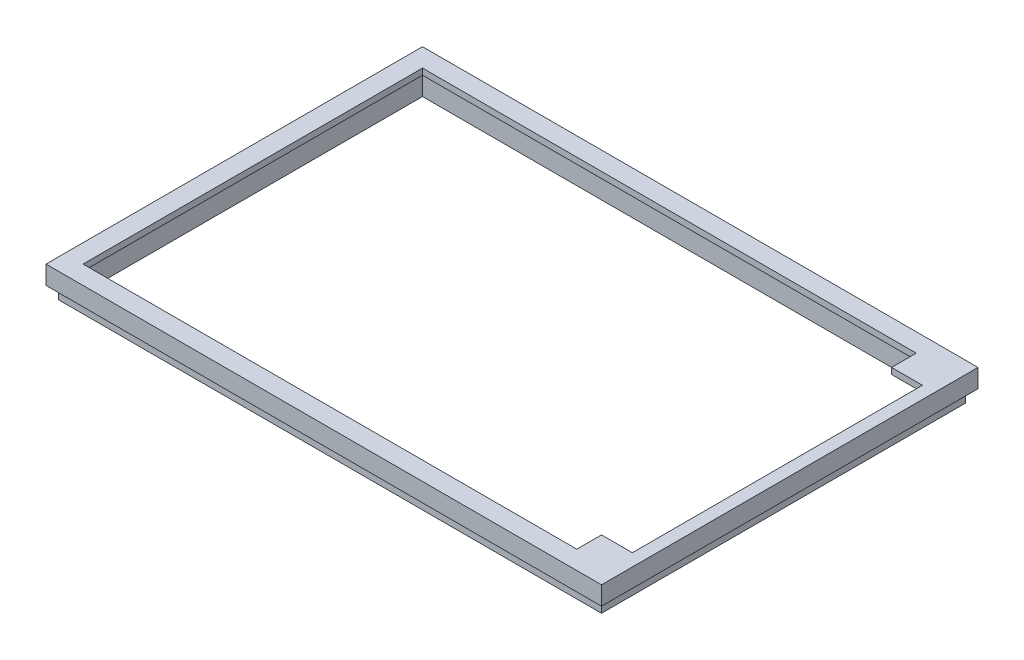
ISO-10303-21;
HEADER;
FILE_DESCRIPTION(('STEP AP214'),'2;1');
FILE_NAME('part.step','',(''),(''),'','','');
FILE_SCHEMA(('AUTOMOTIVE_DESIGN { 1 0 10303 214 1 1 1 1 }'));
ENDSEC;
DATA;
#1=APPLICATION_CONTEXT('core data for automotive mechanical design processes');
#2=APPLICATION_PROTOCOL_DEFINITION('international standard','automotive_design',2000,#1);
#3=PRODUCT_CONTEXT('',#1,'mechanical');
#4=PRODUCT('Part','Part','',(#3));
#5=PRODUCT_RELATED_PRODUCT_CATEGORY('part','',(#4));
#6=PRODUCT_DEFINITION_FORMATION('','',#4);
#7=PRODUCT_DEFINITION_CONTEXT('part definition',#1,'design');
#8=PRODUCT_DEFINITION('design','',#6,#7);
#9=PRODUCT_DEFINITION_SHAPE('','',#8);
#10=(LENGTH_UNIT() NAMED_UNIT(*) SI_UNIT(.MILLI.,.METRE.));
#11=(NAMED_UNIT(*) PLANE_ANGLE_UNIT() SI_UNIT($,.RADIAN.));
#12=(NAMED_UNIT(*) SI_UNIT($,.STERADIAN.) SOLID_ANGLE_UNIT());
#13=UNCERTAINTY_MEASURE_WITH_UNIT(LENGTH_MEASURE(1.E-05),#10,'distance_accuracy_value','');
#14=(GEOMETRIC_REPRESENTATION_CONTEXT(3) GLOBAL_UNCERTAINTY_ASSIGNED_CONTEXT((#13)) GLOBAL_UNIT_ASSIGNED_CONTEXT((#10,
#11,#12)) REPRESENTATION_CONTEXT('',''));
#15=CARTESIAN_POINT('',(0.,0.,0.));
#16=DIRECTION('',(0.,0.,1.));
#17=DIRECTION('',(1.,0.,0.));
#18=AXIS2_PLACEMENT_3D('',#15,#16,#17);
#19=CARTESIAN_POINT('',(0.,0.,0.));
#20=DIRECTION('',(0.,1.,0.));
#21=DIRECTION('',(0.,0.,1.));
#22=AXIS2_PLACEMENT_3D('',#19,#20,#21);
#23=PLANE('',#22);
#24=DIRECTION('',(0.,0.,1.));
#25=VECTOR('',#24,1.);
#26=CARTESIAN_POINT('',(0.,0.,-61.));
#27=LINE('',#26,#25);
#28=CARTESIAN_POINT('',(0.,0.,-61.));
#29=VERTEX_POINT('',#28);
#30=CARTESIAN_POINT('',(0.,0.,0.));
#31=VERTEX_POINT('',#30);
#32=EDGE_CURVE('E299',#29,#31,#27,.T.);
#33=ORIENTED_EDGE('',*,*,#32,.F.);
#34=DIRECTION('',(-1.,0.,0.));
#35=VECTOR('',#34,1.);
#36=CARTESIAN_POINT('',(90.,0.,-61.));
#37=LINE('',#36,#35);
#38=CARTESIAN_POINT('',(90.,0.,-61.));
#39=VERTEX_POINT('',#38);
#40=EDGE_CURVE('E304',#39,#29,#37,.T.);
#41=ORIENTED_EDGE('',*,*,#40,.F.);
#42=DIRECTION('',(0.,0.,-1.));
#43=VECTOR('',#42,1.);
#44=CARTESIAN_POINT('',(90.,0.,0.));
#45=LINE('',#44,#43);
#46=CARTESIAN_POINT('',(90.,0.,0.));
#47=VERTEX_POINT('',#46);
#48=EDGE_CURVE('E315',#47,#39,#45,.T.);
#49=ORIENTED_EDGE('',*,*,#48,.F.);
#50=DIRECTION('',(1.,0.,0.));
#51=VECTOR('',#50,1.);
#52=CARTESIAN_POINT('',(0.,0.,0.));
#53=LINE('',#52,#51);
#54=EDGE_CURVE('E313',#31,#47,#53,.T.);
#55=ORIENTED_EDGE('',*,*,#54,.F.);
#56=EDGE_LOOP('',(#33,#41,#49,#55));
#57=FACE_BOUND('',#56,.T.);
#58=DIRECTION('',(0.,0.,-1.));
#59=VECTOR('',#58,1.);
#60=CARTESIAN_POINT('',(1.,0.,-60.));
#61=LINE('',#60,#59);
#62=CARTESIAN_POINT('',(1.,0.,-1.));
#63=VERTEX_POINT('',#62);
#64=CARTESIAN_POINT('',(1.,0.,-60.));
#65=VERTEX_POINT('',#64);
#66=EDGE_CURVE('E197',#63,#65,#61,.T.);
#67=ORIENTED_EDGE('',*,*,#66,.F.);
#68=DIRECTION('',(-1.,0.,0.));
#69=VECTOR('',#68,1.);
#70=CARTESIAN_POINT('',(1.,0.,-1.));
#71=LINE('',#70,#69);
#72=CARTESIAN_POINT('',(89.,0.,-1.));
#73=VERTEX_POINT('',#72);
#74=EDGE_CURVE('E202',#73,#63,#71,.T.);
#75=ORIENTED_EDGE('',*,*,#74,.F.);
#76=DIRECTION('',(0.,0.,1.));
#77=VECTOR('',#76,1.);
#78=CARTESIAN_POINT('',(89.,0.,-1.));
#79=LINE('',#78,#77);
#80=CARTESIAN_POINT('',(89.,0.,-60.));
#81=VERTEX_POINT('',#80);
#82=EDGE_CURVE('E52',#81,#73,#79,.T.);
#83=ORIENTED_EDGE('',*,*,#82,.F.);
#84=DIRECTION('',(1.,0.,0.));
#85=VECTOR('',#84,1.);
#86=CARTESIAN_POINT('',(89.,0.,-60.));
#87=LINE('',#86,#85);
#88=EDGE_CURVE('E47',#65,#81,#87,.T.);
#89=ORIENTED_EDGE('',*,*,#88,.F.);
#90=EDGE_LOOP('',(#67,#75,#83,#89));
#91=FACE_BOUND('',#90,.T.);
#92=ADVANCED_FACE('F32',(#57,#91),#23,.F.);
#93=CARTESIAN_POINT('',(88.,3.,-59.));
#94=DIRECTION('',(0.,0.,1.));
#95=DIRECTION('',(1.,0.,0.));
#96=AXIS2_PLACEMENT_3D('',#93,#94,#95);
#97=PLANE('',#96);
#98=DIRECTION('',(0.,-1.,0.));
#99=VECTOR('',#98,1.);
#100=CARTESIAN_POINT('',(88.,3.,-59.));
#101=LINE('',#100,#99);
#102=CARTESIAN_POINT('',(88.,2.,-59.));
#103=VERTEX_POINT('',#102);
#104=CARTESIAN_POINT('',(88.,-2.,-59.));
#105=VERTEX_POINT('',#104);
#106=EDGE_CURVE('E178',#103,#105,#101,.T.);
#107=ORIENTED_EDGE('',*,*,#106,.F.);
#108=DIRECTION('',(-1.,0.,0.));
#109=VECTOR('',#108,1.);
#110=CARTESIAN_POINT('',(88.,2.,-59.));
#111=LINE('',#110,#109);
#112=CARTESIAN_POINT('',(2.,2.,-59.));
#113=VERTEX_POINT('',#112);
#114=EDGE_CURVE('E175',#103,#113,#111,.T.);
#115=ORIENTED_EDGE('',*,*,#114,.T.);
#116=DIRECTION('',(0.,-1.,0.));
#117=VECTOR('',#116,1.);
#118=CARTESIAN_POINT('',(2.,3.,-59.));
#119=LINE('',#118,#117);
#120=CARTESIAN_POINT('',(2.,-2.,-59.));
#121=VERTEX_POINT('',#120);
#122=EDGE_CURVE('E167',#113,#121,#119,.T.);
#123=ORIENTED_EDGE('',*,*,#122,.T.);
#124=DIRECTION('',(1.,0.,0.));
#125=VECTOR('',#124,1.);
#126=CARTESIAN_POINT('',(88.,-2.,-59.));
#127=LINE('',#126,#125);
#128=EDGE_CURVE('E172',#121,#105,#127,.T.);
#129=ORIENTED_EDGE('',*,*,#128,.T.);
#130=EDGE_LOOP('',(#107,#115,#123,#129));
#131=FACE_BOUND('',#130,.T.);
#132=ADVANCED_FACE('F170',(#131),#97,.T.);
#133=CARTESIAN_POINT('',(2.,3.,-59.));
#134=DIRECTION('',(1.,0.,0.));
#135=DIRECTION('',(0.,0.,-1.));
#136=AXIS2_PLACEMENT_3D('',#133,#134,#135);
#137=PLANE('',#136);
#138=ORIENTED_EDGE('',*,*,#122,.F.);
#139=DIRECTION('',(0.,0.,1.));
#140=VECTOR('',#139,1.);
#141=CARTESIAN_POINT('',(2.,2.,-2.));
#142=LINE('',#141,#140);
#143=CARTESIAN_POINT('',(2.,2.,-2.));
#144=VERTEX_POINT('',#143);
#145=EDGE_CURVE('E230',#113,#144,#142,.T.);
#146=ORIENTED_EDGE('',*,*,#145,.T.);
#147=DIRECTION('',(0.,-1.,0.));
#148=VECTOR('',#147,1.);
#149=CARTESIAN_POINT('',(2.,3.,-2.));
#150=LINE('',#149,#148);
#151=CARTESIAN_POINT('',(2.,-2.,-2.));
#152=VERTEX_POINT('',#151);
#153=EDGE_CURVE('E179',#144,#152,#150,.T.);
#154=ORIENTED_EDGE('',*,*,#153,.T.);
#155=DIRECTION('',(0.,0.,-1.));
#156=VECTOR('',#155,1.);
#157=CARTESIAN_POINT('',(2.,-2.,-59.));
#158=LINE('',#157,#156);
#159=EDGE_CURVE('E182',#152,#121,#158,.T.);
#160=ORIENTED_EDGE('',*,*,#159,.T.);
#161=EDGE_LOOP('',(#138,#146,#154,#160));
#162=FACE_BOUND('',#161,.T.);
#163=ADVANCED_FACE('F183',(#162),#137,.T.);
#164=CARTESIAN_POINT('',(2.,3.,-2.));
#165=DIRECTION('',(0.,0.,-1.));
#166=DIRECTION('',(-1.,0.,0.));
#167=AXIS2_PLACEMENT_3D('',#164,#165,#166);
#168=PLANE('',#167);
#169=ORIENTED_EDGE('',*,*,#153,.F.);
#170=DIRECTION('',(1.,0.,0.));
#171=VECTOR('',#170,1.);
#172=CARTESIAN_POINT('',(3.00000000000001,2.,-2.));
#173=LINE('',#172,#171);
#174=CARTESIAN_POINT('',(88.,2.,-2.));
#175=VERTEX_POINT('',#174);
#176=EDGE_CURVE('E232',#144,#175,#173,.T.);
#177=ORIENTED_EDGE('',*,*,#176,.T.);
#178=DIRECTION('',(0.,-1.,0.));
#179=VECTOR('',#178,1.);
#180=CARTESIAN_POINT('',(88.,3.,-2.));
#181=LINE('',#180,#179);
#182=CARTESIAN_POINT('',(88.,-2.,-2.));
#183=VERTEX_POINT('',#182);
#184=EDGE_CURVE('E295',#175,#183,#181,.T.);
#185=ORIENTED_EDGE('',*,*,#184,.T.);
#186=DIRECTION('',(-1.,0.,0.));
#187=VECTOR('',#186,1.);
#188=CARTESIAN_POINT('',(2.,-2.,-2.));
#189=LINE('',#188,#187);
#190=EDGE_CURVE('E193',#183,#152,#189,.T.);
#191=ORIENTED_EDGE('',*,*,#190,.T.);
#192=EDGE_LOOP('',(#169,#177,#185,#191));
#193=FACE_BOUND('',#192,.T.);
#194=ADVANCED_FACE('F374',(#193),#168,.T.);
#195=CARTESIAN_POINT('',(0.,3.,0.));
#196=DIRECTION('',(0.,1.,0.));
#197=DIRECTION('',(0.,0.,1.));
#198=AXIS2_PLACEMENT_3D('',#195,#196,#197);
#199=PLANE('',#198);
#200=DIRECTION('',(0.,0.,-1.));
#201=VECTOR('',#200,1.);
#202=CARTESIAN_POINT('',(88.,3.,-2.));
#203=LINE('',#202,#201);
#204=CARTESIAN_POINT('',(88.,3.,-7.));
#205=VERTEX_POINT('',#204);
#206=CARTESIAN_POINT('',(88.,3.,-54.));
#207=VERTEX_POINT('',#206);
#208=EDGE_CURVE('E280',#205,#207,#203,.T.);
#209=ORIENTED_EDGE('',*,*,#208,.F.);
#210=DIRECTION('',(-1.,0.,0.));
#211=VECTOR('',#210,1.);
#212=CARTESIAN_POINT('',(83.,3.,-7.));
#213=LINE('',#212,#211);
#214=CARTESIAN_POINT('',(83.,3.,-7.));
#215=VERTEX_POINT('',#214);
#216=EDGE_CURVE('E225',#205,#215,#213,.T.);
#217=ORIENTED_EDGE('',*,*,#216,.T.);
#218=DIRECTION('',(0.,0.,1.));
#219=VECTOR('',#218,1.);
#220=CARTESIAN_POINT('',(83.,3.,-2.99999999999999));
#221=LINE('',#220,#219);
#222=CARTESIAN_POINT('',(83.,3.,-2.99999999999999));
#223=VERTEX_POINT('',#222);
#224=EDGE_CURVE('E260',#215,#223,#221,.T.);
#225=ORIENTED_EDGE('',*,*,#224,.T.);
#226=DIRECTION('',(-1.,0.,0.));
#227=VECTOR('',#226,1.);
#228=CARTESIAN_POINT('',(3.,3.,-3.));
#229=LINE('',#228,#227);
#230=CARTESIAN_POINT('',(3.,3.,-3.));
#231=VERTEX_POINT('',#230);
#232=EDGE_CURVE('E263',#223,#231,#229,.T.);
#233=ORIENTED_EDGE('',*,*,#232,.T.);
#234=DIRECTION('',(0.,0.,-1.));
#235=VECTOR('',#234,1.);
#236=CARTESIAN_POINT('',(3.,3.,-58.));
#237=LINE('',#236,#235);
#238=CARTESIAN_POINT('',(3.,3.,-58.));
#239=VERTEX_POINT('',#238);
#240=EDGE_CURVE('E266',#231,#239,#237,.T.);
#241=ORIENTED_EDGE('',*,*,#240,.T.);
#242=DIRECTION('',(1.,0.,0.));
#243=VECTOR('',#242,1.);
#244=CARTESIAN_POINT('',(3.,3.,-58.));
#245=LINE('',#244,#243);
#246=CARTESIAN_POINT('',(83.,3.,-58.));
#247=VERTEX_POINT('',#246);
#248=EDGE_CURVE('E269',#239,#247,#245,.T.);
#249=ORIENTED_EDGE('',*,*,#248,.T.);
#250=DIRECTION('',(0.,0.,1.));
#251=VECTOR('',#250,1.);
#252=CARTESIAN_POINT('',(83.,3.,-58.));
#253=LINE('',#252,#251);
#254=CARTESIAN_POINT('',(83.,3.,-54.));
#255=VERTEX_POINT('',#254);
#256=EDGE_CURVE('E272',#247,#255,#253,.T.);
#257=ORIENTED_EDGE('',*,*,#256,.T.);
#258=DIRECTION('',(1.,0.,0.));
#259=VECTOR('',#258,1.);
#260=CARTESIAN_POINT('',(83.,3.,-54.));
#261=LINE('',#260,#259);
#262=EDGE_CURVE('E228',#255,#207,#261,.T.);
#263=ORIENTED_EDGE('',*,*,#262,.T.);
#264=EDGE_LOOP('',(#209,#217,#225,#233,#241,#249,#257,#263));
#265=FACE_BOUND('',#264,.T.);
#266=DIRECTION('',(0.,0.,1.));
#267=VECTOR('',#266,1.);
#268=CARTESIAN_POINT('',(0.,3.,-61.));
#269=LINE('',#268,#267);
#270=CARTESIAN_POINT('',(0.,3.,-61.));
#271=VERTEX_POINT('',#270);
#272=CARTESIAN_POINT('',(0.,3.,0.));
#273=VERTEX_POINT('',#272);
#274=EDGE_CURVE('E300',#271,#273,#269,.T.);
#275=ORIENTED_EDGE('',*,*,#274,.T.);
#276=DIRECTION('',(1.,0.,0.));
#277=VECTOR('',#276,1.);
#278=CARTESIAN_POINT('',(0.,3.,0.));
#279=LINE('',#278,#277);
#280=CARTESIAN_POINT('',(90.,3.,0.));
#281=VERTEX_POINT('',#280);
#282=EDGE_CURVE('E303',#273,#281,#279,.T.);
#283=ORIENTED_EDGE('',*,*,#282,.T.);
#284=DIRECTION('',(0.,0.,-1.));
#285=VECTOR('',#284,1.);
#286=CARTESIAN_POINT('',(90.,3.,0.));
#287=LINE('',#286,#285);
#288=CARTESIAN_POINT('',(90.,3.,-61.));
#289=VERTEX_POINT('',#288);
#290=EDGE_CURVE('E306',#281,#289,#287,.T.);
#291=ORIENTED_EDGE('',*,*,#290,.T.);
#292=DIRECTION('',(-1.,0.,0.));
#293=VECTOR('',#292,1.);
#294=CARTESIAN_POINT('',(90.,3.,-61.));
#295=LINE('',#294,#293);
#296=EDGE_CURVE('E308',#289,#271,#295,.T.);
#297=ORIENTED_EDGE('',*,*,#296,.T.);
#298=EDGE_LOOP('',(#275,#283,#291,#297));
#299=FACE_BOUND('',#298,.T.);
#300=ADVANCED_FACE('F341',(#265,#299),#199,.T.);
#301=CARTESIAN_POINT('',(0.,3.,-61.));
#302=DIRECTION('',(1.,0.,0.));
#303=DIRECTION('',(0.,0.,-1.));
#304=AXIS2_PLACEMENT_3D('',#301,#302,#303);
#305=PLANE('',#304);
#306=ORIENTED_EDGE('',*,*,#32,.T.);
#307=DIRECTION('',(0.,-1.,0.));
#308=VECTOR('',#307,1.);
#309=CARTESIAN_POINT('',(0.,3.,0.));
#310=LINE('',#309,#308);
#311=EDGE_CURVE('E11',#273,#31,#310,.T.);
#312=ORIENTED_EDGE('',*,*,#311,.F.);
#313=ORIENTED_EDGE('',*,*,#274,.F.);
#314=DIRECTION('',(0.,-1.,0.));
#315=VECTOR('',#314,1.);
#316=CARTESIAN_POINT('',(0.,3.,-61.));
#317=LINE('',#316,#315);
#318=EDGE_CURVE('E310',#271,#29,#317,.T.);
#319=ORIENTED_EDGE('',*,*,#318,.T.);
#320=EDGE_LOOP('',(#306,#312,#313,#319));
#321=FACE_BOUND('',#320,.T.);
#322=ADVANCED_FACE('F34',(#321),#305,.F.);
#323=CARTESIAN_POINT('',(0.,3.,0.));
#324=DIRECTION('',(0.,0.,-1.));
#325=DIRECTION('',(-1.,0.,0.));
#326=AXIS2_PLACEMENT_3D('',#323,#324,#325);
#327=PLANE('',#326);
#328=ORIENTED_EDGE('',*,*,#54,.T.);
#329=DIRECTION('',(0.,-1.,0.));
#330=VECTOR('',#329,1.);
#331=CARTESIAN_POINT('',(90.,3.,0.));
#332=LINE('',#331,#330);
#333=EDGE_CURVE('E40',#281,#47,#332,.T.);
#334=ORIENTED_EDGE('',*,*,#333,.F.);
#335=ORIENTED_EDGE('',*,*,#282,.F.);
#336=ORIENTED_EDGE('',*,*,#311,.T.);
#337=EDGE_LOOP('',(#328,#334,#335,#336));
#338=FACE_BOUND('',#337,.T.);
#339=ADVANCED_FACE('F342',(#338),#327,.F.);
#340=CARTESIAN_POINT('',(90.,3.,0.));
#341=DIRECTION('',(-1.,0.,0.));
#342=DIRECTION('',(0.,0.,1.));
#343=AXIS2_PLACEMENT_3D('',#340,#341,#342);
#344=PLANE('',#343);
#345=ORIENTED_EDGE('',*,*,#48,.T.);
#346=DIRECTION('',(0.,-1.,0.));
#347=VECTOR('',#346,1.);
#348=CARTESIAN_POINT('',(90.,3.,-61.));
#349=LINE('',#348,#347);
#350=EDGE_CURVE('E320',#289,#39,#349,.T.);
#351=ORIENTED_EDGE('',*,*,#350,.F.);
#352=ORIENTED_EDGE('',*,*,#290,.F.);
#353=ORIENTED_EDGE('',*,*,#333,.T.);
#354=EDGE_LOOP('',(#345,#351,#352,#353));
#355=FACE_BOUND('',#354,.T.);
#356=ADVANCED_FACE('F327',(#355),#344,.F.);
#357=CARTESIAN_POINT('',(90.,3.,-61.));
#358=DIRECTION('',(0.,0.,1.));
#359=DIRECTION('',(1.,0.,0.));
#360=AXIS2_PLACEMENT_3D('',#357,#358,#359);
#361=PLANE('',#360);
#362=ORIENTED_EDGE('',*,*,#40,.T.);
#363=ORIENTED_EDGE('',*,*,#318,.F.);
#364=ORIENTED_EDGE('',*,*,#296,.F.);
#365=ORIENTED_EDGE('',*,*,#350,.T.);
#366=EDGE_LOOP('',(#362,#363,#364,#365));
#367=FACE_BOUND('',#366,.T.);
#368=ADVANCED_FACE('F335',(#367),#361,.F.);
#369=CARTESIAN_POINT('',(88.,3.,-2.));
#370=DIRECTION('',(-1.,0.,0.));
#371=DIRECTION('',(0.,0.,1.));
#372=AXIS2_PLACEMENT_3D('',#369,#370,#371);
#373=PLANE('',#372);
#374=DIRECTION('',(0.,1.,0.));
#375=VECTOR('',#374,1.);
#376=CARTESIAN_POINT('',(88.,2.,-7.));
#377=LINE('',#376,#375);
#378=CARTESIAN_POINT('',(88.,2.,-7.));
#379=VERTEX_POINT('',#378);
#380=EDGE_CURVE('E257',#379,#205,#377,.T.);
#381=ORIENTED_EDGE('',*,*,#380,.T.);
#382=ORIENTED_EDGE('',*,*,#208,.T.);
#383=DIRECTION('',(0.,1.,0.));
#384=VECTOR('',#383,1.);
#385=CARTESIAN_POINT('',(88.,2.,-54.));
#386=LINE('',#385,#384);
#387=CARTESIAN_POINT('',(88.,2.,-54.));
#388=VERTEX_POINT('',#387);
#389=EDGE_CURVE('E277',#388,#207,#386,.T.);
#390=ORIENTED_EDGE('',*,*,#389,.F.);
#391=DIRECTION('',(0.,0.,-1.));
#392=VECTOR('',#391,1.);
#393=CARTESIAN_POINT('',(88.,2.,-54.));
#394=LINE('',#393,#392);
#395=EDGE_CURVE('E226',#388,#103,#394,.T.);
#396=ORIENTED_EDGE('',*,*,#395,.T.);
#397=ORIENTED_EDGE('',*,*,#106,.T.);
#398=DIRECTION('',(0.,0.,1.));
#399=VECTOR('',#398,1.);
#400=CARTESIAN_POINT('',(88.,-2.,-2.));
#401=LINE('',#400,#399);
#402=EDGE_CURVE('E191',#105,#183,#401,.T.);
#403=ORIENTED_EDGE('',*,*,#402,.T.);
#404=ORIENTED_EDGE('',*,*,#184,.F.);
#405=DIRECTION('',(0.,0.,-1.));
#406=VECTOR('',#405,1.);
#407=CARTESIAN_POINT('',(88.,2.,-7.));
#408=LINE('',#407,#406);
#409=EDGE_CURVE('E234',#175,#379,#408,.T.);
#410=ORIENTED_EDGE('',*,*,#409,.T.);
#411=EDGE_LOOP('',(#381,#382,#390,#396,#397,#403,#404,#410));
#412=FACE_BOUND('',#411,.T.);
#413=ADVANCED_FACE('F359',(#412),#373,.T.);
#414=CARTESIAN_POINT('',(83.,2.,-54.));
#415=DIRECTION('',(0.,0.,1.));
#416=DIRECTION('',(1.,0.,0.));
#417=AXIS2_PLACEMENT_3D('',#414,#415,#416);
#418=PLANE('',#417);
#419=ORIENTED_EDGE('',*,*,#262,.F.);
#420=DIRECTION('',(0.,1.,0.));
#421=VECTOR('',#420,1.);
#422=CARTESIAN_POINT('',(83.,2.,-54.));
#423=LINE('',#422,#421);
#424=CARTESIAN_POINT('',(83.,2.,-54.));
#425=VERTEX_POINT('',#424);
#426=EDGE_CURVE('E281',#425,#255,#423,.T.);
#427=ORIENTED_EDGE('',*,*,#426,.F.);
#428=DIRECTION('',(1.,0.,0.));
#429=VECTOR('',#428,1.);
#430=CARTESIAN_POINT('',(83.,2.,-54.));
#431=LINE('',#430,#429);
#432=EDGE_CURVE('E254',#425,#388,#431,.T.);
#433=ORIENTED_EDGE('',*,*,#432,.T.);
#434=ORIENTED_EDGE('',*,*,#389,.T.);
#435=EDGE_LOOP('',(#419,#427,#433,#434));
#436=FACE_BOUND('',#435,.T.);
#437=ADVANCED_FACE('F363',(#436),#418,.T.);
#438=CARTESIAN_POINT('',(83.,2.,-58.));
#439=DIRECTION('',(-1.,0.,0.));
#440=DIRECTION('',(0.,0.,1.));
#441=AXIS2_PLACEMENT_3D('',#438,#439,#440);
#442=PLANE('',#441);
#443=ORIENTED_EDGE('',*,*,#256,.F.);
#444=DIRECTION('',(0.,1.,0.));
#445=VECTOR('',#444,1.);
#446=CARTESIAN_POINT('',(83.,2.,-58.));
#447=LINE('',#446,#445);
#448=CARTESIAN_POINT('',(83.,2.,-58.));
#449=VERTEX_POINT('',#448);
#450=EDGE_CURVE('E283',#449,#247,#447,.T.);
#451=ORIENTED_EDGE('',*,*,#450,.F.);
#452=DIRECTION('',(0.,0.,1.));
#453=VECTOR('',#452,1.);
#454=CARTESIAN_POINT('',(83.,2.,-58.));
#455=LINE('',#454,#453);
#456=EDGE_CURVE('E251',#449,#425,#455,.T.);
#457=ORIENTED_EDGE('',*,*,#456,.T.);
#458=ORIENTED_EDGE('',*,*,#426,.T.);
#459=EDGE_LOOP('',(#443,#451,#457,#458));
#460=FACE_BOUND('',#459,.T.);
#461=ADVANCED_FACE('F368',(#460),#442,.T.);
#462=CARTESIAN_POINT('',(3.,2.,-58.));
#463=DIRECTION('',(0.,0.,1.));
#464=DIRECTION('',(1.,0.,0.));
#465=AXIS2_PLACEMENT_3D('',#462,#463,#464);
#466=PLANE('',#465);
#467=ORIENTED_EDGE('',*,*,#248,.F.);
#468=DIRECTION('',(0.,1.,0.));
#469=VECTOR('',#468,1.);
#470=CARTESIAN_POINT('',(3.,2.,-58.));
#471=LINE('',#470,#469);
#472=CARTESIAN_POINT('',(3.,2.,-58.));
#473=VERTEX_POINT('',#472);
#474=EDGE_CURVE('E285',#473,#239,#471,.T.);
#475=ORIENTED_EDGE('',*,*,#474,.F.);
#476=DIRECTION('',(1.,0.,0.));
#477=VECTOR('',#476,1.);
#478=CARTESIAN_POINT('',(3.,2.,-58.));
#479=LINE('',#478,#477);
#480=EDGE_CURVE('E248',#473,#449,#479,.T.);
#481=ORIENTED_EDGE('',*,*,#480,.T.);
#482=ORIENTED_EDGE('',*,*,#450,.T.);
#483=EDGE_LOOP('',(#467,#475,#481,#482));
#484=FACE_BOUND('',#483,.T.);
#485=ADVANCED_FACE('F394',(#484),#466,.T.);
#486=CARTESIAN_POINT('',(3.,2.,-58.));
#487=DIRECTION('',(1.,0.,0.));
#488=DIRECTION('',(0.,0.,-1.));
#489=AXIS2_PLACEMENT_3D('',#486,#487,#488);
#490=PLANE('',#489);
#491=ORIENTED_EDGE('',*,*,#240,.F.);
#492=DIRECTION('',(0.,1.,0.));
#493=VECTOR('',#492,1.);
#494=CARTESIAN_POINT('',(3.,2.,-3.));
#495=LINE('',#494,#493);
#496=CARTESIAN_POINT('',(3.,2.,-3.));
#497=VERTEX_POINT('',#496);
#498=EDGE_CURVE('E287',#497,#231,#495,.T.);
#499=ORIENTED_EDGE('',*,*,#498,.F.);
#500=DIRECTION('',(0.,0.,-1.));
#501=VECTOR('',#500,1.);
#502=CARTESIAN_POINT('',(3.,2.,-58.));
#503=LINE('',#502,#501);
#504=EDGE_CURVE('E245',#497,#473,#503,.T.);
#505=ORIENTED_EDGE('',*,*,#504,.T.);
#506=ORIENTED_EDGE('',*,*,#474,.T.);
#507=EDGE_LOOP('',(#491,#499,#505,#506));
#508=FACE_BOUND('',#507,.T.);
#509=ADVANCED_FACE('F390',(#508),#490,.T.);
#510=CARTESIAN_POINT('',(3.,2.,-3.));
#511=DIRECTION('',(0.,0.,-1.));
#512=DIRECTION('',(-1.,0.,0.));
#513=AXIS2_PLACEMENT_3D('',#510,#511,#512);
#514=PLANE('',#513);
#515=ORIENTED_EDGE('',*,*,#232,.F.);
#516=DIRECTION('',(0.,1.,0.));
#517=VECTOR('',#516,1.);
#518=CARTESIAN_POINT('',(83.,2.,-2.99999999999999));
#519=LINE('',#518,#517);
#520=CARTESIAN_POINT('',(83.,2.,-2.99999999999999));
#521=VERTEX_POINT('',#520);
#522=EDGE_CURVE('E289',#521,#223,#519,.T.);
#523=ORIENTED_EDGE('',*,*,#522,.F.);
#524=DIRECTION('',(-1.,0.,0.));
#525=VECTOR('',#524,1.);
#526=CARTESIAN_POINT('',(3.,2.,-3.));
#527=LINE('',#526,#525);
#528=EDGE_CURVE('E242',#521,#497,#527,.T.);
#529=ORIENTED_EDGE('',*,*,#528,.T.);
#530=ORIENTED_EDGE('',*,*,#498,.T.);
#531=EDGE_LOOP('',(#515,#523,#529,#530));
#532=FACE_BOUND('',#531,.T.);
#533=ADVANCED_FACE('F386',(#532),#514,.T.);
#534=CARTESIAN_POINT('',(83.,2.,-2.99999999999999));
#535=DIRECTION('',(-1.,0.,0.));
#536=DIRECTION('',(0.,0.,1.));
#537=AXIS2_PLACEMENT_3D('',#534,#535,#536);
#538=PLANE('',#537);
#539=ORIENTED_EDGE('',*,*,#224,.F.);
#540=DIRECTION('',(0.,1.,0.));
#541=VECTOR('',#540,1.);
#542=CARTESIAN_POINT('',(83.,2.,-7.));
#543=LINE('',#542,#541);
#544=CARTESIAN_POINT('',(83.,2.,-7.));
#545=VERTEX_POINT('',#544);
#546=EDGE_CURVE('E291',#545,#215,#543,.T.);
#547=ORIENTED_EDGE('',*,*,#546,.F.);
#548=DIRECTION('',(0.,0.,1.));
#549=VECTOR('',#548,1.);
#550=CARTESIAN_POINT('',(83.,2.,-2.99999999999999));
#551=LINE('',#550,#549);
#552=EDGE_CURVE('E239',#545,#521,#551,.T.);
#553=ORIENTED_EDGE('',*,*,#552,.T.);
#554=ORIENTED_EDGE('',*,*,#522,.T.);
#555=EDGE_LOOP('',(#539,#547,#553,#554));
#556=FACE_BOUND('',#555,.T.);
#557=ADVANCED_FACE('F382',(#556),#538,.T.);
#558=CARTESIAN_POINT('',(83.,2.,-7.));
#559=DIRECTION('',(0.,0.,-1.));
#560=DIRECTION('',(-1.,0.,0.));
#561=AXIS2_PLACEMENT_3D('',#558,#559,#560);
#562=PLANE('',#561);
#563=ORIENTED_EDGE('',*,*,#216,.F.);
#564=ORIENTED_EDGE('',*,*,#380,.F.);
#565=DIRECTION('',(-1.,0.,0.));
#566=VECTOR('',#565,1.);
#567=CARTESIAN_POINT('',(83.,2.,-7.));
#568=LINE('',#567,#566);
#569=EDGE_CURVE('E236',#379,#545,#568,.T.);
#570=ORIENTED_EDGE('',*,*,#569,.T.);
#571=ORIENTED_EDGE('',*,*,#546,.T.);
#572=EDGE_LOOP('',(#563,#564,#570,#571));
#573=FACE_BOUND('',#572,.T.);
#574=ADVANCED_FACE('F378',(#573),#562,.T.);
#575=CARTESIAN_POINT('',(0.,2.,0.));
#576=DIRECTION('',(0.,1.,0.));
#577=DIRECTION('',(0.,0.,1.));
#578=AXIS2_PLACEMENT_3D('',#575,#576,#577);
#579=PLANE('',#578);
#580=ORIENTED_EDGE('',*,*,#395,.F.);
#581=ORIENTED_EDGE('',*,*,#432,.F.);
#582=ORIENTED_EDGE('',*,*,#456,.F.);
#583=ORIENTED_EDGE('',*,*,#480,.F.);
#584=ORIENTED_EDGE('',*,*,#504,.F.);
#585=ORIENTED_EDGE('',*,*,#528,.F.);
#586=ORIENTED_EDGE('',*,*,#552,.F.);
#587=ORIENTED_EDGE('',*,*,#569,.F.);
#588=ORIENTED_EDGE('',*,*,#409,.F.);
#589=ORIENTED_EDGE('',*,*,#176,.F.);
#590=ORIENTED_EDGE('',*,*,#145,.F.);
#591=ORIENTED_EDGE('',*,*,#114,.F.);
#592=EDGE_LOOP('',(#580,#581,#582,#583,#584,#585,#586,#587,#588,#589,#590,#591));
#593=FACE_BOUND('',#592,.T.);
#594=ADVANCED_FACE('F381',(#593),#579,.F.);
#595=CARTESIAN_POINT('',(0.,-2.,0.));
#596=DIRECTION('',(0.,1.,0.));
#597=DIRECTION('',(0.,0.,1.));
#598=AXIS2_PLACEMENT_3D('',#595,#596,#597);
#599=PLANE('',#598);
#600=DIRECTION('',(0.,0.,-1.));
#601=VECTOR('',#600,1.);
#602=CARTESIAN_POINT('',(1.,-2.,-60.));
#603=LINE('',#602,#601);
#604=CARTESIAN_POINT('',(1.,-2.,-1.));
#605=VERTEX_POINT('',#604);
#606=CARTESIAN_POINT('',(1.,-2.,-60.));
#607=VERTEX_POINT('',#606);
#608=EDGE_CURVE('E198',#605,#607,#603,.T.);
#609=ORIENTED_EDGE('',*,*,#608,.T.);
#610=DIRECTION('',(1.,0.,0.));
#611=VECTOR('',#610,1.);
#612=CARTESIAN_POINT('',(89.,-2.,-60.));
#613=LINE('',#612,#611);
#614=CARTESIAN_POINT('',(89.,-2.,-60.));
#615=VERTEX_POINT('',#614);
#616=EDGE_CURVE('E201',#607,#615,#613,.T.);
#617=ORIENTED_EDGE('',*,*,#616,.T.);
#618=DIRECTION('',(0.,0.,1.));
#619=VECTOR('',#618,1.);
#620=CARTESIAN_POINT('',(89.,-2.,-1.));
#621=LINE('',#620,#619);
#622=CARTESIAN_POINT('',(89.,-2.,-1.));
#623=VERTEX_POINT('',#622);
#624=EDGE_CURVE('E204',#615,#623,#621,.T.);
#625=ORIENTED_EDGE('',*,*,#624,.T.);
#626=DIRECTION('',(-1.,0.,0.));
#627=VECTOR('',#626,1.);
#628=CARTESIAN_POINT('',(1.,-2.,-1.));
#629=LINE('',#628,#627);
#630=EDGE_CURVE('E206',#623,#605,#629,.T.);
#631=ORIENTED_EDGE('',*,*,#630,.T.);
#632=EDGE_LOOP('',(#609,#617,#625,#631));
#633=FACE_BOUND('',#632,.T.);
#634=ORIENTED_EDGE('',*,*,#159,.F.);
#635=ORIENTED_EDGE('',*,*,#190,.F.);
#636=ORIENTED_EDGE('',*,*,#402,.F.);
#637=ORIENTED_EDGE('',*,*,#128,.F.);
#638=EDGE_LOOP('',(#634,#635,#636,#637));
#639=FACE_BOUND('',#638,.T.);
#640=ADVANCED_FACE('F189',(#633,#639),#599,.F.);
#641=CARTESIAN_POINT('',(1.,-2.,-60.));
#642=DIRECTION('',(1.,0.,0.));
#643=DIRECTION('',(0.,0.,-1.));
#644=AXIS2_PLACEMENT_3D('',#641,#642,#643);
#645=PLANE('',#644);
#646=ORIENTED_EDGE('',*,*,#66,.T.);
#647=DIRECTION('',(0.,1.,0.));
#648=VECTOR('',#647,1.);
#649=CARTESIAN_POINT('',(1.,-2.,-60.));
#650=LINE('',#649,#648);
#651=EDGE_CURVE('E223',#607,#65,#650,.T.);
#652=ORIENTED_EDGE('',*,*,#651,.F.);
#653=ORIENTED_EDGE('',*,*,#608,.F.);
#654=DIRECTION('',(0.,1.,0.));
#655=VECTOR('',#654,1.);
#656=CARTESIAN_POINT('',(1.,-2.,-1.));
#657=LINE('',#656,#655);
#658=EDGE_CURVE('E208',#605,#63,#657,.T.);
#659=ORIENTED_EDGE('',*,*,#658,.T.);
#660=EDGE_LOOP('',(#646,#652,#653,#659));
#661=FACE_BOUND('',#660,.T.);
#662=ADVANCED_FACE('F405',(#661),#645,.F.);
#663=CARTESIAN_POINT('',(89.,-2.,-60.));
#664=DIRECTION('',(0.,0.,1.));
#665=DIRECTION('',(1.,0.,0.));
#666=AXIS2_PLACEMENT_3D('',#663,#664,#665);
#667=PLANE('',#666);
#668=ORIENTED_EDGE('',*,*,#88,.T.);
#669=DIRECTION('',(0.,1.,0.));
#670=VECTOR('',#669,1.);
#671=CARTESIAN_POINT('',(89.,-2.,-60.));
#672=LINE('',#671,#670);
#673=EDGE_CURVE('E220',#615,#81,#672,.T.);
#674=ORIENTED_EDGE('',*,*,#673,.F.);
#675=ORIENTED_EDGE('',*,*,#616,.F.);
#676=ORIENTED_EDGE('',*,*,#651,.T.);
#677=EDGE_LOOP('',(#668,#674,#675,#676));
#678=FACE_BOUND('',#677,.T.);
#679=ADVANCED_FACE('F408',(#678),#667,.F.);
#680=CARTESIAN_POINT('',(89.,-2.,-1.));
#681=DIRECTION('',(-1.,0.,0.));
#682=DIRECTION('',(0.,0.,1.));
#683=AXIS2_PLACEMENT_3D('',#680,#681,#682);
#684=PLANE('',#683);
#685=ORIENTED_EDGE('',*,*,#82,.T.);
#686=DIRECTION('',(0.,1.,0.));
#687=VECTOR('',#686,1.);
#688=CARTESIAN_POINT('',(89.,-2.,-1.));
#689=LINE('',#688,#687);
#690=EDGE_CURVE('E217',#623,#73,#689,.T.);
#691=ORIENTED_EDGE('',*,*,#690,.F.);
#692=ORIENTED_EDGE('',*,*,#624,.F.);
#693=ORIENTED_EDGE('',*,*,#673,.T.);
#694=EDGE_LOOP('',(#685,#691,#692,#693));
#695=FACE_BOUND('',#694,.T.);
#696=ADVANCED_FACE('F412',(#695),#684,.F.);
#697=CARTESIAN_POINT('',(1.,-2.,-1.));
#698=DIRECTION('',(0.,0.,-1.));
#699=DIRECTION('',(-1.,0.,0.));
#700=AXIS2_PLACEMENT_3D('',#697,#698,#699);
#701=PLANE('',#700);
#702=ORIENTED_EDGE('',*,*,#74,.T.);
#703=ORIENTED_EDGE('',*,*,#658,.F.);
#704=ORIENTED_EDGE('',*,*,#630,.F.);
#705=ORIENTED_EDGE('',*,*,#690,.T.);
#706=EDGE_LOOP('',(#702,#703,#704,#705));
#707=FACE_BOUND('',#706,.T.);
#708=ADVANCED_FACE('F416',(#707),#701,.F.);
#709=CLOSED_SHELL('',(#92,#132,#163,#194,#300,#322,#339,#356,#368,#413,#437,#461,#485,#509,#533,
#557,#574,#594,#640,#662,#679,#696,#708));
#710=MANIFOLD_SOLID_BREP('B2',#709);
#711=ADVANCED_BREP_SHAPE_REPRESENTATION('',(#18,#710),#14);
#712=SHAPE_DEFINITION_REPRESENTATION(#9,#711);
ENDSEC;
END-ISO-10303-21;
